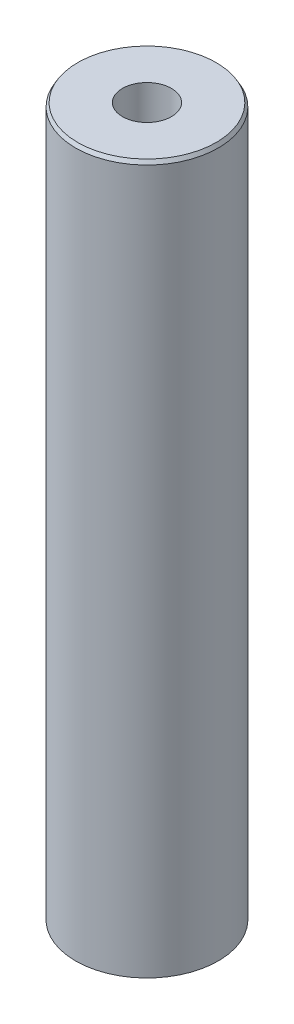
ISO-10303-21;
HEADER;
FILE_DESCRIPTION(('STEP AP214'),'2;1');
FILE_NAME('part.step','',(''),(''),'','','');
FILE_SCHEMA(('AUTOMOTIVE_DESIGN { 1 0 10303 214 1 1 1 1 }'));
ENDSEC;
DATA;
#1=APPLICATION_CONTEXT('core data for automotive mechanical design processes');
#2=APPLICATION_PROTOCOL_DEFINITION('international standard','automotive_design',2000,#1);
#3=PRODUCT_CONTEXT('',#1,'mechanical');
#4=PRODUCT('Part','Part','',(#3));
#5=PRODUCT_RELATED_PRODUCT_CATEGORY('part','',(#4));
#6=PRODUCT_DEFINITION_FORMATION('','',#4);
#7=PRODUCT_DEFINITION_CONTEXT('part definition',#1,'design');
#8=PRODUCT_DEFINITION('design','',#6,#7);
#9=PRODUCT_DEFINITION_SHAPE('','',#8);
#10=(LENGTH_UNIT() NAMED_UNIT(*) SI_UNIT(.MILLI.,.METRE.));
#11=(NAMED_UNIT(*) PLANE_ANGLE_UNIT() SI_UNIT($,.RADIAN.));
#12=(NAMED_UNIT(*) SI_UNIT($,.STERADIAN.) SOLID_ANGLE_UNIT());
#13=UNCERTAINTY_MEASURE_WITH_UNIT(LENGTH_MEASURE(1.E-05),#10,'distance_accuracy_value','');
#14=(GEOMETRIC_REPRESENTATION_CONTEXT(3) GLOBAL_UNCERTAINTY_ASSIGNED_CONTEXT((#13)) GLOBAL_UNIT_ASSIGNED_CONTEXT((#10,
#11,#12)) REPRESENTATION_CONTEXT('',''));
#15=CARTESIAN_POINT('',(0.,0.,0.));
#16=DIRECTION('',(0.,0.,1.));
#17=DIRECTION('',(1.,0.,0.));
#18=AXIS2_PLACEMENT_3D('',#15,#16,#17);
#19=CARTESIAN_POINT('',(0.,99.4656471871904,0.));
#20=DIRECTION('',(0.,-1.,0.));
#21=DIRECTION('',(0.,0.,-1.));
#22=AXIS2_PLACEMENT_3D('',#19,#20,#21);
#23=CYLINDRICAL_SURFACE('',#22,10.);
#24=CARTESIAN_POINT('',(0.,98.9465599000406,0.));
#25=DIRECTION('',(0.,1.,0.));
#26=DIRECTION('',(0.,0.,1.));
#27=AXIS2_PLACEMENT_3D('',#24,#25,#26);
#28=CIRCLE('',#27,10.);
#29=CARTESIAN_POINT('',(0.,98.9465599000406,10.));
#30=VERTEX_POINT('',#29);
#31=EDGE_CURVE('E50',#30,#30,#28,.F.);
#32=ORIENTED_EDGE('',*,*,#31,.T.);
#33=EDGE_LOOP('',(#32));
#34=FACE_BOUND('',#33,.T.);
#35=CARTESIAN_POINT('',(0.,0.299695184968848,0.));
#36=DIRECTION('',(0.,1.,0.));
#37=DIRECTION('',(0.,0.,1.));
#38=AXIS2_PLACEMENT_3D('',#35,#36,#37);
#39=CIRCLE('',#38,10.);
#40=CARTESIAN_POINT('',(0.,0.299695184968848,10.));
#41=VERTEX_POINT('',#40);
#42=EDGE_CURVE('E51',#41,#41,#39,.T.);
#43=ORIENTED_EDGE('',*,*,#42,.T.);
#44=EDGE_LOOP('',(#43));
#45=FACE_BOUND('',#44,.T.);
#46=ADVANCED_FACE('F39',(#34,#45),#23,.T.);
#47=CARTESIAN_POINT('',(0.,99.4656471871904,0.));
#48=DIRECTION('',(0.,1.,0.));
#49=DIRECTION('',(0.,0.,1.));
#50=AXIS2_PLACEMENT_3D('',#47,#48,#49);
#51=PLANE('',#50);
#52=CARTESIAN_POINT('',(0.,99.4656471871904,0.));
#53=DIRECTION('',(0.,1.,0.));
#54=DIRECTION('',(0.,0.,1.));
#55=AXIS2_PLACEMENT_3D('',#52,#53,#54);
#56=CIRCLE('',#55,9.70030481503115);
#57=CARTESIAN_POINT('',(0.,99.4656471871904,9.70030481503115));
#58=VERTEX_POINT('',#57);
#59=EDGE_CURVE('E54',#58,#58,#56,.T.);
#60=ORIENTED_EDGE('',*,*,#59,.T.);
#61=EDGE_LOOP('',(#60));
#62=FACE_BOUND('',#61,.T.);
#63=CARTESIAN_POINT('',(0.,99.4656471871904,0.));
#64=DIRECTION('',(0.,1.,0.));
#65=DIRECTION('',(0.,0.,1.));
#66=AXIS2_PLACEMENT_3D('',#63,#64,#65);
#67=CIRCLE('',#66,3.43288398946361);
#68=CARTESIAN_POINT('',(0.,99.4656471871904,3.43288398946361));
#69=VERTEX_POINT('',#68);
#70=EDGE_CURVE('E58',#69,#69,#67,.T.);
#71=ORIENTED_EDGE('',*,*,#70,.F.);
#72=EDGE_LOOP('',(#71));
#73=FACE_BOUND('',#72,.T.);
#74=ADVANCED_FACE('F69',(#62,#73),#51,.T.);
#75=CARTESIAN_POINT('',(0.,0.,0.));
#76=DIRECTION('',(0.,1.,0.));
#77=DIRECTION('',(0.,0.,1.));
#78=AXIS2_PLACEMENT_3D('',#75,#76,#77);
#79=PLANE('',#78);
#80=CARTESIAN_POINT('',(0.,0.,0.));
#81=DIRECTION('',(0.,1.,0.));
#82=DIRECTION('',(0.,0.,1.));
#83=AXIS2_PLACEMENT_3D('',#80,#81,#82);
#84=CIRCLE('',#83,9.48091271285019);
#85=CARTESIAN_POINT('',(0.,0.,9.48091271285019));
#86=VERTEX_POINT('',#85);
#87=EDGE_CURVE('E10',#86,#86,#84,.F.);
#88=ORIENTED_EDGE('',*,*,#87,.T.);
#89=EDGE_LOOP('',(#88));
#90=FACE_BOUND('',#89,.T.);
#91=CARTESIAN_POINT('',(0.,0.,0.));
#92=DIRECTION('',(0.,1.,0.));
#93=DIRECTION('',(0.,0.,1.));
#94=AXIS2_PLACEMENT_3D('',#91,#92,#93);
#95=CIRCLE('',#94,3.43288398946361);
#96=CARTESIAN_POINT('',(0.,0.,3.43288398946361));
#97=VERTEX_POINT('',#96);
#98=EDGE_CURVE('E63',#97,#97,#95,.T.);
#99=ORIENTED_EDGE('',*,*,#98,.T.);
#100=EDGE_LOOP('',(#99));
#101=FACE_BOUND('',#100,.T.);
#102=ADVANCED_FACE('F75',(#90,#101),#79,.F.);
#103=CARTESIAN_POINT('',(0.,99.4656471871904,0.));
#104=DIRECTION('',(0.,-1.,0.));
#105=DIRECTION('',(0.,0.,-1.));
#106=AXIS2_PLACEMENT_3D('',#103,#104,#105);
#107=CYLINDRICAL_SURFACE('',#106,3.43288398946361);
#108=ORIENTED_EDGE('',*,*,#70,.T.);
#109=EDGE_LOOP('',(#108));
#110=FACE_BOUND('',#109,.T.);
#111=ORIENTED_EDGE('',*,*,#98,.F.);
#112=EDGE_LOOP('',(#111));
#113=FACE_BOUND('',#112,.T.);
#114=ADVANCED_FACE('F70',(#110,#113),#107,.F.);
#115=CARTESIAN_POINT('',(0.,99.4656471871904,0.));
#116=DIRECTION('',(0.,-1.,0.));
#117=DIRECTION('',(0.,0.,-1.));
#118=AXIS2_PLACEMENT_3D('',#115,#116,#117);
#119=CONICAL_SURFACE('',#118,9.70030481503115,0.523598775598289);
#120=ORIENTED_EDGE('',*,*,#31,.F.);
#121=EDGE_LOOP('',(#120));
#122=FACE_BOUND('',#121,.T.);
#123=ORIENTED_EDGE('',*,*,#59,.F.);
#124=EDGE_LOOP('',(#123));
#125=FACE_BOUND('',#124,.T.);
#126=ADVANCED_FACE('F81',(#122,#125),#119,.T.);
#127=CARTESIAN_POINT('',(0.,0.299695184968848,0.));
#128=DIRECTION('',(0.,1.,0.));
#129=DIRECTION('',(0.,0.,1.));
#130=AXIS2_PLACEMENT_3D('',#127,#128,#129);
#131=CONICAL_SURFACE('',#130,10.,1.04719755119661);
#132=ORIENTED_EDGE('',*,*,#87,.F.);
#133=EDGE_LOOP('',(#132));
#134=FACE_BOUND('',#133,.T.);
#135=ORIENTED_EDGE('',*,*,#42,.F.);
#136=EDGE_LOOP('',(#135));
#137=FACE_BOUND('',#136,.T.);
#138=ADVANCED_FACE('F45',(#134,#137),#131,.T.);
#139=CLOSED_SHELL('',(#46,#74,#102,#114,#126,#138));
#140=MANIFOLD_SOLID_BREP('B2',#139);
#141=ADVANCED_BREP_SHAPE_REPRESENTATION('',(#18,#140),#14);
#142=SHAPE_DEFINITION_REPRESENTATION(#9,#141);
ENDSEC;
END-ISO-10303-21;
